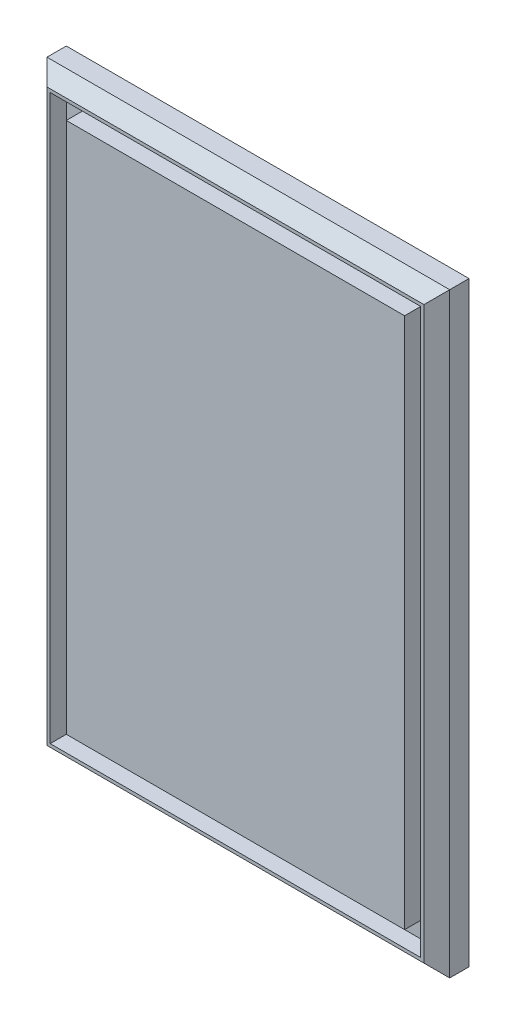
ISO-10303-21;
HEADER;
FILE_DESCRIPTION(('STEP AP214'),'2;1');
FILE_NAME('part.step','',(''),(''),'','','');
FILE_SCHEMA(('AUTOMOTIVE_DESIGN { 1 0 10303 214 1 1 1 1 }'));
ENDSEC;
DATA;
#1=APPLICATION_CONTEXT('core data for automotive mechanical design processes');
#2=APPLICATION_PROTOCOL_DEFINITION('international standard','automotive_design',2000,#1);
#3=PRODUCT_CONTEXT('',#1,'mechanical');
#4=PRODUCT('Part','Part','',(#3));
#5=PRODUCT_RELATED_PRODUCT_CATEGORY('part','',(#4));
#6=PRODUCT_DEFINITION_FORMATION('','',#4);
#7=PRODUCT_DEFINITION_CONTEXT('part definition',#1,'design');
#8=PRODUCT_DEFINITION('design','',#6,#7);
#9=PRODUCT_DEFINITION_SHAPE('','',#8);
#10=(LENGTH_UNIT() NAMED_UNIT(*) SI_UNIT(.MILLI.,.METRE.));
#11=(NAMED_UNIT(*) PLANE_ANGLE_UNIT() SI_UNIT($,.RADIAN.));
#12=(NAMED_UNIT(*) SI_UNIT($,.STERADIAN.) SOLID_ANGLE_UNIT());
#13=UNCERTAINTY_MEASURE_WITH_UNIT(LENGTH_MEASURE(1.E-05),#10,'distance_accuracy_value','');
#14=(GEOMETRIC_REPRESENTATION_CONTEXT(3) GLOBAL_UNCERTAINTY_ASSIGNED_CONTEXT((#13)) GLOBAL_UNIT_ASSIGNED_CONTEXT((#10,
#11,#12)) REPRESENTATION_CONTEXT('',''));
#15=CARTESIAN_POINT('',(0.,0.,0.));
#16=DIRECTION('',(0.,0.,1.));
#17=DIRECTION('',(1.,0.,0.));
#18=AXIS2_PLACEMENT_3D('',#15,#16,#17);
#19=CARTESIAN_POINT('',(-125.,185.,20.));
#20=DIRECTION('',(0.,1.,0.));
#21=DIRECTION('',(0.,0.,1.));
#22=AXIS2_PLACEMENT_3D('',#19,#20,#21);
#23=PLANE('',#22);
#24=DIRECTION('',(0.,0.,-1.));
#25=VECTOR('',#24,1.);
#26=CARTESIAN_POINT('',(-125.,185.,20.));
#27=LINE('',#26,#25);
#28=CARTESIAN_POINT('',(-125.,185.,12.));
#29=VERTEX_POINT('',#28);
#30=CARTESIAN_POINT('',(-125.,185.,0.));
#31=VERTEX_POINT('',#30);
#32=EDGE_CURVE('E227',#29,#31,#27,.T.);
#33=ORIENTED_EDGE('',*,*,#32,.F.);
#34=DIRECTION('',(1.,0.,0.));
#35=VECTOR('',#34,1.);
#36=CARTESIAN_POINT('',(125.,185.,12.));
#37=LINE('',#36,#35);
#38=CARTESIAN_POINT('',(125.,185.,12.));
#39=VERTEX_POINT('',#38);
#40=EDGE_CURVE('E11',#29,#39,#37,.T.);
#41=ORIENTED_EDGE('',*,*,#40,.T.);
#42=DIRECTION('',(0.,0.,-1.));
#43=VECTOR('',#42,1.);
#44=CARTESIAN_POINT('',(125.,185.,20.));
#45=LINE('',#44,#43);
#46=CARTESIAN_POINT('',(125.,185.,0.));
#47=VERTEX_POINT('',#46);
#48=EDGE_CURVE('E226',#39,#47,#45,.T.);
#49=ORIENTED_EDGE('',*,*,#48,.T.);
#50=DIRECTION('',(1.,0.,0.));
#51=VECTOR('',#50,1.);
#52=CARTESIAN_POINT('',(-125.,185.,0.));
#53=LINE('',#52,#51);
#54=EDGE_CURVE('E214',#31,#47,#53,.T.);
#55=ORIENTED_EDGE('',*,*,#54,.F.);
#56=EDGE_LOOP('',(#33,#41,#49,#55));
#57=FACE_BOUND('',#56,.T.);
#58=ADVANCED_FACE('F39',(#57),#23,.T.);
#59=CARTESIAN_POINT('',(-125.,185.,20.));
#60=DIRECTION('',(1.,0.,0.));
#61=DIRECTION('',(0.,1.,0.));
#62=AXIS2_PLACEMENT_3D('',#59,#60,#61);
#63=PLANE('',#62);
#64=DIRECTION('',(0.,0.,-1.));
#65=VECTOR('',#64,1.);
#66=CARTESIAN_POINT('',(-125.,-185.,20.));
#67=LINE('',#66,#65);
#68=CARTESIAN_POINT('',(-125.,-185.,12.));
#69=VERTEX_POINT('',#68);
#70=CARTESIAN_POINT('',(-125.,-185.,0.));
#71=VERTEX_POINT('',#70);
#72=EDGE_CURVE('E230',#69,#71,#67,.T.);
#73=ORIENTED_EDGE('',*,*,#72,.F.);
#74=DIRECTION('',(0.,1.,0.));
#75=VECTOR('',#74,1.);
#76=CARTESIAN_POINT('',(-125.,185.,12.));
#77=LINE('',#76,#75);
#78=EDGE_CURVE('E49',#69,#29,#77,.T.);
#79=ORIENTED_EDGE('',*,*,#78,.T.);
#80=ORIENTED_EDGE('',*,*,#32,.T.);
#81=DIRECTION('',(0.,-1.,0.));
#82=VECTOR('',#81,1.);
#83=CARTESIAN_POINT('',(-125.,185.,0.));
#84=LINE('',#83,#82);
#85=EDGE_CURVE('E223',#31,#71,#84,.T.);
#86=ORIENTED_EDGE('',*,*,#85,.T.);
#87=EDGE_LOOP('',(#73,#79,#80,#86));
#88=FACE_BOUND('',#87,.T.);
#89=ADVANCED_FACE('F291',(#88),#63,.F.);
#90=CARTESIAN_POINT('',(-125.,-185.,20.));
#91=DIRECTION('',(0.,1.,0.));
#92=DIRECTION('',(0.,0.,1.));
#93=AXIS2_PLACEMENT_3D('',#90,#91,#92);
#94=PLANE('',#93);
#95=DIRECTION('',(0.,0.,-1.));
#96=VECTOR('',#95,1.);
#97=CARTESIAN_POINT('',(125.,-185.,20.));
#98=LINE('',#97,#96);
#99=CARTESIAN_POINT('',(125.,-185.,12.));
#100=VERTEX_POINT('',#99);
#101=CARTESIAN_POINT('',(125.,-185.,0.));
#102=VERTEX_POINT('',#101);
#103=EDGE_CURVE('E232',#100,#102,#98,.T.);
#104=ORIENTED_EDGE('',*,*,#103,.F.);
#105=DIRECTION('',(-1.,0.,0.));
#106=VECTOR('',#105,1.);
#107=CARTESIAN_POINT('',(-125.,-185.,12.));
#108=LINE('',#107,#106);
#109=EDGE_CURVE('E246',#100,#69,#108,.T.);
#110=ORIENTED_EDGE('',*,*,#109,.T.);
#111=ORIENTED_EDGE('',*,*,#72,.T.);
#112=DIRECTION('',(1.,0.,0.));
#113=VECTOR('',#112,1.);
#114=CARTESIAN_POINT('',(-125.,-185.,0.));
#115=LINE('',#114,#113);
#116=EDGE_CURVE('E220',#71,#102,#115,.T.);
#117=ORIENTED_EDGE('',*,*,#116,.T.);
#118=EDGE_LOOP('',(#104,#110,#111,#117));
#119=FACE_BOUND('',#118,.T.);
#120=ADVANCED_FACE('F282',(#119),#94,.F.);
#121=CARTESIAN_POINT('',(125.,185.,20.));
#122=DIRECTION('',(1.,0.,0.));
#123=DIRECTION('',(0.,1.,0.));
#124=AXIS2_PLACEMENT_3D('',#121,#122,#123);
#125=PLANE('',#124);
#126=ORIENTED_EDGE('',*,*,#48,.F.);
#127=DIRECTION('',(0.,-1.,0.));
#128=VECTOR('',#127,1.);
#129=CARTESIAN_POINT('',(125.,-185.,12.));
#130=LINE('',#129,#128);
#131=EDGE_CURVE('E229',#39,#100,#130,.T.);
#132=ORIENTED_EDGE('',*,*,#131,.T.);
#133=ORIENTED_EDGE('',*,*,#103,.T.);
#134=DIRECTION('',(0.,-1.,0.));
#135=VECTOR('',#134,1.);
#136=CARTESIAN_POINT('',(125.,185.,0.));
#137=LINE('',#136,#135);
#138=EDGE_CURVE('E217',#47,#102,#137,.T.);
#139=ORIENTED_EDGE('',*,*,#138,.F.);
#140=EDGE_LOOP('',(#126,#132,#133,#139));
#141=FACE_BOUND('',#140,.T.);
#142=ADVANCED_FACE('F280',(#141),#125,.T.);
#143=CARTESIAN_POINT('',(0.,0.,20.));
#144=DIRECTION('',(0.,0.,-1.));
#145=DIRECTION('',(-1.,0.,0.));
#146=AXIS2_PLACEMENT_3D('',#143,#144,#145);
#147=PLANE('',#146);
#148=DIRECTION('',(1.,0.,0.));
#149=VECTOR('',#148,1.);
#150=CARTESIAN_POINT('',(115.,-175.,20.));
#151=LINE('',#150,#149);
#152=CARTESIAN_POINT('',(-115.,-175.,20.));
#153=VERTEX_POINT('',#152);
#154=CARTESIAN_POINT('',(115.,-175.,20.));
#155=VERTEX_POINT('',#154);
#156=EDGE_CURVE('E198',#153,#155,#151,.T.);
#157=ORIENTED_EDGE('',*,*,#156,.F.);
#158=DIRECTION('',(0.,-1.,0.));
#159=VECTOR('',#158,1.);
#160=CARTESIAN_POINT('',(-115.,-175.,20.));
#161=LINE('',#160,#159);
#162=CARTESIAN_POINT('',(-115.,175.,20.));
#163=VERTEX_POINT('',#162);
#164=EDGE_CURVE('E57',#163,#153,#161,.T.);
#165=ORIENTED_EDGE('',*,*,#164,.F.);
#166=DIRECTION('',(-1.,0.,0.));
#167=VECTOR('',#166,1.);
#168=CARTESIAN_POINT('',(115.,175.,20.));
#169=LINE('',#168,#167);
#170=CARTESIAN_POINT('',(115.,175.,20.));
#171=VERTEX_POINT('',#170);
#172=EDGE_CURVE('E187',#171,#163,#169,.T.);
#173=ORIENTED_EDGE('',*,*,#172,.F.);
#174=DIRECTION('',(0.,1.,0.));
#175=VECTOR('',#174,1.);
#176=CARTESIAN_POINT('',(115.,-175.,20.));
#177=LINE('',#176,#175);
#178=EDGE_CURVE('E201',#155,#171,#177,.T.);
#179=ORIENTED_EDGE('',*,*,#178,.F.);
#180=EDGE_LOOP('',(#157,#165,#173,#179));
#181=FACE_BOUND('',#180,.T.);
#182=DIRECTION('',(1.,0.,0.));
#183=VECTOR('',#182,1.);
#184=CARTESIAN_POINT('',(0.,-177.,20.));
#185=LINE('',#184,#183);
#186=CARTESIAN_POINT('',(-117.,-177.,20.));
#187=VERTEX_POINT('',#186);
#188=CARTESIAN_POINT('',(117.,-177.,20.));
#189=VERTEX_POINT('',#188);
#190=EDGE_CURVE('E241',#187,#189,#185,.T.);
#191=ORIENTED_EDGE('',*,*,#190,.T.);
#192=DIRECTION('',(0.,1.,0.));
#193=VECTOR('',#192,1.);
#194=CARTESIAN_POINT('',(117.,185.,20.));
#195=LINE('',#194,#193);
#196=CARTESIAN_POINT('',(117.,177.,20.));
#197=VERTEX_POINT('',#196);
#198=EDGE_CURVE('E243',#189,#197,#195,.T.);
#199=ORIENTED_EDGE('',*,*,#198,.T.);
#200=DIRECTION('',(-1.,0.,0.));
#201=VECTOR('',#200,1.);
#202=CARTESIAN_POINT('',(-125.,177.,20.));
#203=LINE('',#202,#201);
#204=CARTESIAN_POINT('',(-117.,177.,20.));
#205=VERTEX_POINT('',#204);
#206=EDGE_CURVE('E237',#197,#205,#203,.T.);
#207=ORIENTED_EDGE('',*,*,#206,.T.);
#208=DIRECTION('',(0.,-1.,0.));
#209=VECTOR('',#208,1.);
#210=CARTESIAN_POINT('',(-117.,0.,20.));
#211=LINE('',#210,#209);
#212=EDGE_CURVE('E239',#205,#187,#211,.T.);
#213=ORIENTED_EDGE('',*,*,#212,.T.);
#214=EDGE_LOOP('',(#191,#199,#207,#213));
#215=FACE_BOUND('',#214,.T.);
#216=ADVANCED_FACE('F268',(#181,#215),#147,.F.);
#217=CARTESIAN_POINT('',(0.,0.,0.));
#218=DIRECTION('',(0.,0.,-1.));
#219=DIRECTION('',(-1.,0.,0.));
#220=AXIS2_PLACEMENT_3D('',#217,#218,#219);
#221=PLANE('',#220);
#222=ORIENTED_EDGE('',*,*,#54,.T.);
#223=ORIENTED_EDGE('',*,*,#138,.T.);
#224=ORIENTED_EDGE('',*,*,#116,.F.);
#225=ORIENTED_EDGE('',*,*,#85,.F.);
#226=EDGE_LOOP('',(#222,#223,#224,#225));
#227=FACE_BOUND('',#226,.T.);
#228=ADVANCED_FACE('F286',(#227),#221,.T.);
#229=CARTESIAN_POINT('',(-117.,0.,20.));
#230=DIRECTION('',(0.707106781186547,0.,-0.707106781186547));
#231=DIRECTION('',(0.,-1.,0.));
#232=AXIS2_PLACEMENT_3D('',#229,#230,#231);
#233=PLANE('',#232);
#234=DIRECTION('',(0.577350269189626,0.577350269189626,0.577350269189626));
#235=VECTOR('',#234,1.);
#236=CARTESIAN_POINT('',(-58.,-118.,79.));
#237=LINE('',#236,#235);
#238=EDGE_CURVE('E251',#187,#69,#237,.F.);
#239=ORIENTED_EDGE('',*,*,#238,.F.);
#240=ORIENTED_EDGE('',*,*,#212,.F.);
#241=DIRECTION('',(-0.577350269189626,0.577350269189626,-0.577350269189626));
#242=VECTOR('',#241,1.);
#243=CARTESIAN_POINT('',(-125.,185.,12.));
#244=LINE('',#243,#242);
#245=EDGE_CURVE('E44',#29,#205,#244,.F.);
#246=ORIENTED_EDGE('',*,*,#245,.F.);
#247=ORIENTED_EDGE('',*,*,#78,.F.);
#248=EDGE_LOOP('',(#239,#240,#246,#247));
#249=FACE_BOUND('',#248,.T.);
#250=ADVANCED_FACE('F42',(#249),#233,.F.);
#251=CARTESIAN_POINT('',(-125.,185.,12.));
#252=DIRECTION('',(0.,0.707106781186547,0.707106781186547));
#253=DIRECTION('',(-1.,0.,0.));
#254=AXIS2_PLACEMENT_3D('',#251,#252,#253);
#255=PLANE('',#254);
#256=ORIENTED_EDGE('',*,*,#245,.T.);
#257=ORIENTED_EDGE('',*,*,#206,.F.);
#258=DIRECTION('',(0.577350269189626,0.577350269189626,-0.577350269189626));
#259=VECTOR('',#258,1.);
#260=CARTESIAN_POINT('',(41.6666666666667,101.666666666667,95.3333333333333));
#261=LINE('',#260,#259);
#262=EDGE_CURVE('E250',#39,#197,#261,.F.);
#263=ORIENTED_EDGE('',*,*,#262,.F.);
#264=ORIENTED_EDGE('',*,*,#40,.F.);
#265=EDGE_LOOP('',(#256,#257,#263,#264));
#266=FACE_BOUND('',#265,.T.);
#267=ADVANCED_FACE('F262',(#266),#255,.T.);
#268=CARTESIAN_POINT('',(0.,-177.,20.));
#269=DIRECTION('',(0.,0.707106781186547,-0.707106781186547));
#270=DIRECTION('',(1.,0.,0.));
#271=AXIS2_PLACEMENT_3D('',#268,#269,#270);
#272=PLANE('',#271);
#273=ORIENTED_EDGE('',*,*,#238,.T.);
#274=ORIENTED_EDGE('',*,*,#109,.F.);
#275=DIRECTION('',(0.577350269189626,-0.577350269189626,-0.577350269189626));
#276=VECTOR('',#275,1.);
#277=CARTESIAN_POINT('',(78.,-138.,59.));
#278=LINE('',#277,#276);
#279=EDGE_CURVE('E208',#189,#100,#278,.T.);
#280=ORIENTED_EDGE('',*,*,#279,.F.);
#281=ORIENTED_EDGE('',*,*,#190,.F.);
#282=EDGE_LOOP('',(#273,#274,#280,#281));
#283=FACE_BOUND('',#282,.T.);
#284=ADVANCED_FACE('F274',(#283),#272,.F.);
#285=CARTESIAN_POINT('',(125.,185.,12.));
#286=DIRECTION('',(0.707106781186547,0.,0.707106781186547));
#287=DIRECTION('',(0.,1.,0.));
#288=AXIS2_PLACEMENT_3D('',#285,#286,#287);
#289=PLANE('',#288);
#290=ORIENTED_EDGE('',*,*,#262,.T.);
#291=ORIENTED_EDGE('',*,*,#198,.F.);
#292=ORIENTED_EDGE('',*,*,#279,.T.);
#293=ORIENTED_EDGE('',*,*,#131,.F.);
#294=EDGE_LOOP('',(#290,#291,#292,#293));
#295=FACE_BOUND('',#294,.T.);
#296=ADVANCED_FACE('F272',(#295),#289,.T.);
#297=CARTESIAN_POINT('',(-115.,-175.,10.));
#298=DIRECTION('',(-1.,0.,0.));
#299=DIRECTION('',(0.,0.,1.));
#300=AXIS2_PLACEMENT_3D('',#297,#298,#299);
#301=PLANE('',#300);
#302=ORIENTED_EDGE('',*,*,#164,.T.);
#303=DIRECTION('',(0.,0.,1.));
#304=VECTOR('',#303,1.);
#305=CARTESIAN_POINT('',(-115.,-175.,10.));
#306=LINE('',#305,#304);
#307=CARTESIAN_POINT('',(-115.,-175.,10.));
#308=VERTEX_POINT('',#307);
#309=EDGE_CURVE('E196',#308,#153,#306,.T.);
#310=ORIENTED_EDGE('',*,*,#309,.F.);
#311=DIRECTION('',(0.,-1.,0.));
#312=VECTOR('',#311,1.);
#313=CARTESIAN_POINT('',(-115.,-175.,10.));
#314=LINE('',#313,#312);
#315=CARTESIAN_POINT('',(-115.,175.,10.));
#316=VERTEX_POINT('',#315);
#317=EDGE_CURVE('E183',#316,#308,#314,.T.);
#318=ORIENTED_EDGE('',*,*,#317,.F.);
#319=DIRECTION('',(0.,0.,1.));
#320=VECTOR('',#319,1.);
#321=CARTESIAN_POINT('',(-115.,175.,10.));
#322=LINE('',#321,#320);
#323=EDGE_CURVE('E206',#316,#163,#322,.T.);
#324=ORIENTED_EDGE('',*,*,#323,.T.);
#325=EDGE_LOOP('',(#302,#310,#318,#324));
#326=FACE_BOUND('',#325,.T.);
#327=ADVANCED_FACE('F311',(#326),#301,.F.);
#328=CARTESIAN_POINT('',(115.,175.,10.));
#329=DIRECTION('',(0.,1.,0.));
#330=DIRECTION('',(0.,0.,1.));
#331=AXIS2_PLACEMENT_3D('',#328,#329,#330);
#332=PLANE('',#331);
#333=ORIENTED_EDGE('',*,*,#172,.T.);
#334=ORIENTED_EDGE('',*,*,#323,.F.);
#335=DIRECTION('',(-1.,0.,0.));
#336=VECTOR('',#335,1.);
#337=CARTESIAN_POINT('',(115.,175.,10.));
#338=LINE('',#337,#336);
#339=CARTESIAN_POINT('',(115.,175.,10.));
#340=VERTEX_POINT('',#339);
#341=EDGE_CURVE('E193',#340,#316,#338,.T.);
#342=ORIENTED_EDGE('',*,*,#341,.F.);
#343=DIRECTION('',(0.,0.,1.));
#344=VECTOR('',#343,1.);
#345=CARTESIAN_POINT('',(115.,175.,10.));
#346=LINE('',#345,#344);
#347=EDGE_CURVE('E209',#340,#171,#346,.T.);
#348=ORIENTED_EDGE('',*,*,#347,.T.);
#349=EDGE_LOOP('',(#333,#334,#342,#348));
#350=FACE_BOUND('',#349,.T.);
#351=ADVANCED_FACE('F356',(#350),#332,.F.);
#352=CARTESIAN_POINT('',(115.,-175.,10.));
#353=DIRECTION('',(1.,0.,0.));
#354=DIRECTION('',(0.,0.,-1.));
#355=AXIS2_PLACEMENT_3D('',#352,#353,#354);
#356=PLANE('',#355);
#357=ORIENTED_EDGE('',*,*,#178,.T.);
#358=ORIENTED_EDGE('',*,*,#347,.F.);
#359=DIRECTION('',(0.,1.,0.));
#360=VECTOR('',#359,1.);
#361=CARTESIAN_POINT('',(115.,-175.,10.));
#362=LINE('',#361,#360);
#363=CARTESIAN_POINT('',(115.,-175.,10.));
#364=VERTEX_POINT('',#363);
#365=EDGE_CURVE('E190',#364,#340,#362,.T.);
#366=ORIENTED_EDGE('',*,*,#365,.F.);
#367=DIRECTION('',(0.,0.,1.));
#368=VECTOR('',#367,1.);
#369=CARTESIAN_POINT('',(115.,-175.,10.));
#370=LINE('',#369,#368);
#371=EDGE_CURVE('E211',#364,#155,#370,.T.);
#372=ORIENTED_EDGE('',*,*,#371,.T.);
#373=EDGE_LOOP('',(#357,#358,#366,#372));
#374=FACE_BOUND('',#373,.T.);
#375=ADVANCED_FACE('F359',(#374),#356,.F.);
#376=CARTESIAN_POINT('',(115.,-175.,10.));
#377=DIRECTION('',(0.,-1.,0.));
#378=DIRECTION('',(0.,0.,-1.));
#379=AXIS2_PLACEMENT_3D('',#376,#377,#378);
#380=PLANE('',#379);
#381=ORIENTED_EDGE('',*,*,#156,.T.);
#382=ORIENTED_EDGE('',*,*,#371,.F.);
#383=DIRECTION('',(1.,0.,0.));
#384=VECTOR('',#383,1.);
#385=CARTESIAN_POINT('',(115.,-175.,10.));
#386=LINE('',#385,#384);
#387=EDGE_CURVE('E186',#308,#364,#386,.T.);
#388=ORIENTED_EDGE('',*,*,#387,.F.);
#389=ORIENTED_EDGE('',*,*,#309,.T.);
#390=EDGE_LOOP('',(#381,#382,#388,#389));
#391=FACE_BOUND('',#390,.T.);
#392=ADVANCED_FACE('F355',(#391),#380,.F.);
#393=CARTESIAN_POINT('',(0.,0.,10.));
#394=DIRECTION('',(0.,0.,1.));
#395=DIRECTION('',(1.,0.,0.));
#396=AXIS2_PLACEMENT_3D('',#393,#394,#395);
#397=PLANE('',#396);
#398=DIRECTION('',(-1.,0.,0.));
#399=VECTOR('',#398,1.);
#400=CARTESIAN_POINT('',(105.,165.,10.));
#401=LINE('',#400,#399);
#402=CARTESIAN_POINT('',(105.,165.,10.));
#403=VERTEX_POINT('',#402);
#404=CARTESIAN_POINT('',(-105.,165.,10.));
#405=VERTEX_POINT('',#404);
#406=EDGE_CURVE('E154',#403,#405,#401,.T.);
#407=ORIENTED_EDGE('',*,*,#406,.F.);
#408=DIRECTION('',(0.,1.,0.));
#409=VECTOR('',#408,1.);
#410=CARTESIAN_POINT('',(105.,-165.,10.));
#411=LINE('',#410,#409);
#412=CARTESIAN_POINT('',(105.,-165.,10.));
#413=VERTEX_POINT('',#412);
#414=EDGE_CURVE('E164',#413,#403,#411,.T.);
#415=ORIENTED_EDGE('',*,*,#414,.F.);
#416=DIRECTION('',(1.,0.,0.));
#417=VECTOR('',#416,1.);
#418=CARTESIAN_POINT('',(105.,-165.,10.));
#419=LINE('',#418,#417);
#420=CARTESIAN_POINT('',(-105.,-165.,10.));
#421=VERTEX_POINT('',#420);
#422=EDGE_CURVE('E146',#421,#413,#419,.T.);
#423=ORIENTED_EDGE('',*,*,#422,.F.);
#424=DIRECTION('',(0.,-1.,0.));
#425=VECTOR('',#424,1.);
#426=CARTESIAN_POINT('',(-105.,-165.,10.));
#427=LINE('',#426,#425);
#428=EDGE_CURVE('E161',#405,#421,#427,.T.);
#429=ORIENTED_EDGE('',*,*,#428,.F.);
#430=EDGE_LOOP('',(#407,#415,#423,#429));
#431=FACE_BOUND('',#430,.T.);
#432=ORIENTED_EDGE('',*,*,#317,.T.);
#433=ORIENTED_EDGE('',*,*,#387,.T.);
#434=ORIENTED_EDGE('',*,*,#365,.T.);
#435=ORIENTED_EDGE('',*,*,#341,.T.);
#436=EDGE_LOOP('',(#432,#433,#434,#435));
#437=FACE_BOUND('',#436,.T.);
#438=ADVANCED_FACE('F159',(#431,#437),#397,.T.);
#439=CARTESIAN_POINT('',(-105.,-165.,10.));
#440=DIRECTION('',(-1.,0.,0.));
#441=DIRECTION('',(0.,0.,1.));
#442=AXIS2_PLACEMENT_3D('',#439,#440,#441);
#443=PLANE('',#442);
#444=DIRECTION('',(0.,-1.,0.));
#445=VECTOR('',#444,1.);
#446=CARTESIAN_POINT('',(-105.,-165.,20.));
#447=LINE('',#446,#445);
#448=CARTESIAN_POINT('',(-105.,165.,20.));
#449=VERTEX_POINT('',#448);
#450=CARTESIAN_POINT('',(-105.,-165.,20.));
#451=VERTEX_POINT('',#450);
#452=EDGE_CURVE('E175',#449,#451,#447,.T.);
#453=ORIENTED_EDGE('',*,*,#452,.F.);
#454=DIRECTION('',(0.,0.,1.));
#455=VECTOR('',#454,1.);
#456=CARTESIAN_POINT('',(-105.,165.,10.));
#457=LINE('',#456,#455);
#458=EDGE_CURVE('E167',#405,#449,#457,.T.);
#459=ORIENTED_EDGE('',*,*,#458,.F.);
#460=ORIENTED_EDGE('',*,*,#428,.T.);
#461=DIRECTION('',(0.,0.,1.));
#462=VECTOR('',#461,1.);
#463=CARTESIAN_POINT('',(-105.,-165.,10.));
#464=LINE('',#463,#462);
#465=EDGE_CURVE('E143',#421,#451,#464,.T.);
#466=ORIENTED_EDGE('',*,*,#465,.T.);
#467=EDGE_LOOP('',(#453,#459,#460,#466));
#468=FACE_BOUND('',#467,.T.);
#469=ADVANCED_FACE('F166',(#468),#443,.T.);
#470=CARTESIAN_POINT('',(105.,165.,10.));
#471=DIRECTION('',(0.,1.,0.));
#472=DIRECTION('',(0.,0.,1.));
#473=AXIS2_PLACEMENT_3D('',#470,#471,#472);
#474=PLANE('',#473);
#475=DIRECTION('',(-1.,0.,0.));
#476=VECTOR('',#475,1.);
#477=CARTESIAN_POINT('',(105.,165.,20.));
#478=LINE('',#477,#476);
#479=CARTESIAN_POINT('',(105.,165.,20.));
#480=VERTEX_POINT('',#479);
#481=EDGE_CURVE('E168',#480,#449,#478,.T.);
#482=ORIENTED_EDGE('',*,*,#481,.F.);
#483=DIRECTION('',(0.,0.,1.));
#484=VECTOR('',#483,1.);
#485=CARTESIAN_POINT('',(105.,165.,10.));
#486=LINE('',#485,#484);
#487=EDGE_CURVE('E180',#403,#480,#486,.T.);
#488=ORIENTED_EDGE('',*,*,#487,.F.);
#489=ORIENTED_EDGE('',*,*,#406,.T.);
#490=ORIENTED_EDGE('',*,*,#458,.T.);
#491=EDGE_LOOP('',(#482,#488,#489,#490));
#492=FACE_BOUND('',#491,.T.);
#493=ADVANCED_FACE('F343',(#492),#474,.T.);
#494=CARTESIAN_POINT('',(105.,-165.,10.));
#495=DIRECTION('',(1.,0.,0.));
#496=DIRECTION('',(0.,0.,-1.));
#497=AXIS2_PLACEMENT_3D('',#494,#495,#496);
#498=PLANE('',#497);
#499=DIRECTION('',(0.,1.,0.));
#500=VECTOR('',#499,1.);
#501=CARTESIAN_POINT('',(105.,-165.,20.));
#502=LINE('',#501,#500);
#503=CARTESIAN_POINT('',(105.,-165.,20.));
#504=VERTEX_POINT('',#503);
#505=EDGE_CURVE('E65',#504,#480,#502,.T.);
#506=ORIENTED_EDGE('',*,*,#505,.F.);
#507=DIRECTION('',(0.,0.,1.));
#508=VECTOR('',#507,1.);
#509=CARTESIAN_POINT('',(105.,-165.,10.));
#510=LINE('',#509,#508);
#511=EDGE_CURVE('E153',#413,#504,#510,.T.);
#512=ORIENTED_EDGE('',*,*,#511,.F.);
#513=ORIENTED_EDGE('',*,*,#414,.T.);
#514=ORIENTED_EDGE('',*,*,#487,.T.);
#515=EDGE_LOOP('',(#506,#512,#513,#514));
#516=FACE_BOUND('',#515,.T.);
#517=ADVANCED_FACE('F339',(#516),#498,.T.);
#518=CARTESIAN_POINT('',(105.,-165.,10.));
#519=DIRECTION('',(0.,-1.,0.));
#520=DIRECTION('',(0.,0.,-1.));
#521=AXIS2_PLACEMENT_3D('',#518,#519,#520);
#522=PLANE('',#521);
#523=DIRECTION('',(1.,0.,0.));
#524=VECTOR('',#523,1.);
#525=CARTESIAN_POINT('',(105.,-165.,20.));
#526=LINE('',#525,#524);
#527=EDGE_CURVE('E148',#451,#504,#526,.T.);
#528=ORIENTED_EDGE('',*,*,#527,.F.);
#529=ORIENTED_EDGE('',*,*,#465,.F.);
#530=ORIENTED_EDGE('',*,*,#422,.T.);
#531=ORIENTED_EDGE('',*,*,#511,.T.);
#532=EDGE_LOOP('',(#528,#529,#530,#531));
#533=FACE_BOUND('',#532,.T.);
#534=ADVANCED_FACE('F145',(#533),#522,.T.);
#535=ORIENTED_EDGE('',*,*,#452,.T.);
#536=ORIENTED_EDGE('',*,*,#527,.T.);
#537=ORIENTED_EDGE('',*,*,#505,.T.);
#538=ORIENTED_EDGE('',*,*,#481,.T.);
#539=EDGE_LOOP('',(#535,#536,#537,#538));
#540=FACE_BOUND('',#539,.T.);
#541=ADVANCED_FACE('F329',(#540),#147,.F.);
#542=CLOSED_SHELL('',(#58,#89,#120,#142,#216,#228,#250,#267,#284,#296,#327,#351,#375,#392,#438,
#469,#493,#517,#534,#541));
#543=MANIFOLD_SOLID_BREP('B2',#542);
#544=ADVANCED_BREP_SHAPE_REPRESENTATION('',(#18,#543),#14);
#545=SHAPE_DEFINITION_REPRESENTATION(#9,#544);
ENDSEC;
END-ISO-10303-21;
